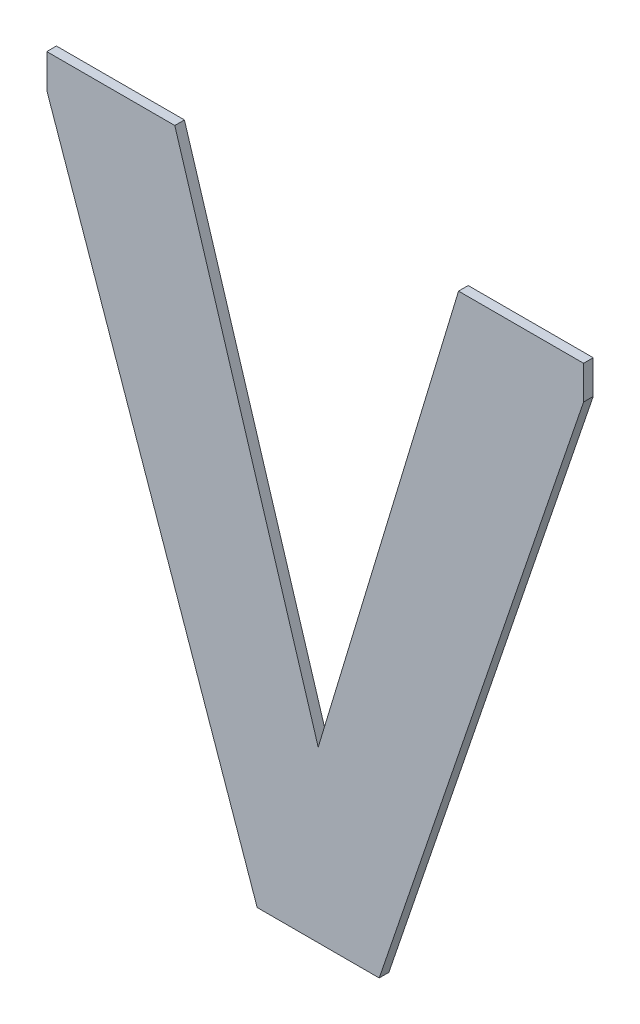
ISO-10303-21;
HEADER;
FILE_DESCRIPTION(('STEP AP214'),'2;1');
FILE_NAME('part.step','',(''),(''),'','','');
FILE_SCHEMA(('AUTOMOTIVE_DESIGN { 1 0 10303 214 1 1 1 1 }'));
ENDSEC;
DATA;
#1=APPLICATION_CONTEXT('core data for automotive mechanical design processes');
#2=APPLICATION_PROTOCOL_DEFINITION('international standard','automotive_design',2000,#1);
#3=PRODUCT_CONTEXT('',#1,'mechanical');
#4=PRODUCT('Part','Part','',(#3));
#5=PRODUCT_RELATED_PRODUCT_CATEGORY('part','',(#4));
#6=PRODUCT_DEFINITION_FORMATION('','',#4);
#7=PRODUCT_DEFINITION_CONTEXT('part definition',#1,'design');
#8=PRODUCT_DEFINITION('design','',#6,#7);
#9=PRODUCT_DEFINITION_SHAPE('','',#8);
#10=(LENGTH_UNIT() NAMED_UNIT(*) SI_UNIT(.MILLI.,.METRE.));
#11=(NAMED_UNIT(*) PLANE_ANGLE_UNIT() SI_UNIT($,.RADIAN.));
#12=(NAMED_UNIT(*) SI_UNIT($,.STERADIAN.) SOLID_ANGLE_UNIT());
#13=UNCERTAINTY_MEASURE_WITH_UNIT(LENGTH_MEASURE(1.E-05),#10,'distance_accuracy_value','');
#14=(GEOMETRIC_REPRESENTATION_CONTEXT(3) GLOBAL_UNCERTAINTY_ASSIGNED_CONTEXT((#13)) GLOBAL_UNIT_ASSIGNED_CONTEXT((#10,
#11,#12)) REPRESENTATION_CONTEXT('',''));
#15=CARTESIAN_POINT('',(0.,0.,0.));
#16=DIRECTION('',(0.,0.,1.));
#17=DIRECTION('',(1.,0.,0.));
#18=AXIS2_PLACEMENT_3D('',#15,#16,#17);
#19=CARTESIAN_POINT('',(3.2441487083548,-0.722389912967327,0.));
#20=DIRECTION('',(0.,1.,0.));
#21=DIRECTION('',(-1.,0.,0.));
#22=AXIS2_PLACEMENT_3D('',#19,#20,#21);
#23=PLANE('',#22);
#24=DIRECTION('',(-1.,0.,0.));
#25=VECTOR('',#24,1.);
#26=CARTESIAN_POINT('',(3.2441487083548,-0.722389912967327,0.));
#27=LINE('',#26,#25);
#28=CARTESIAN_POINT('',(3.2441487083548,-0.722389912967327,0.));
#29=VERTEX_POINT('',#28);
#30=CARTESIAN_POINT('',(3.2043187112414,-0.722389912967327,0.));
#31=VERTEX_POINT('',#30);
#32=EDGE_CURVE('E11',#29,#31,#27,.T.);
#33=ORIENTED_EDGE('',*,*,#32,.T.);
#34=DIRECTION('',(0.,0.,1.));
#35=VECTOR('',#34,1.);
#36=CARTESIAN_POINT('',(3.2043187112414,-0.722389912967327,0.));
#37=LINE('',#36,#35);
#38=CARTESIAN_POINT('',(3.2043187112414,-0.722389912967327,0.003));
#39=VERTEX_POINT('',#38);
#40=EDGE_CURVE('E24',#31,#39,#37,.T.);
#41=ORIENTED_EDGE('',*,*,#40,.T.);
#42=DIRECTION('',(-1.,0.,0.));
#43=VECTOR('',#42,1.);
#44=CARTESIAN_POINT('',(3.2441487083548,-0.722389912967327,0.003));
#45=LINE('',#44,#43);
#46=CARTESIAN_POINT('',(3.2441487083548,-0.722389912967327,0.003));
#47=VERTEX_POINT('',#46);
#48=EDGE_CURVE('E106',#47,#39,#45,.T.);
#49=ORIENTED_EDGE('',*,*,#48,.F.);
#50=DIRECTION('',(0.,0.,1.));
#51=VECTOR('',#50,1.);
#52=CARTESIAN_POINT('',(3.2441487083548,-0.722389912967327,0.));
#53=LINE('',#52,#51);
#54=EDGE_CURVE('E161',#29,#47,#53,.T.);
#55=ORIENTED_EDGE('',*,*,#54,.F.);
#56=EDGE_LOOP('',(#33,#41,#49,#55));
#57=FACE_BOUND('',#56,.T.);
#58=ADVANCED_FACE('F17',(#57),#23,.T.);
#59=CARTESIAN_POINT('',(3.2887624352329,-0.867592688611885,0.));
#60=DIRECTION('',(0.955897450324784,0.293700637490928,0.));
#61=DIRECTION('',(-0.293700637490928,0.955897450324784,0.));
#62=AXIS2_PLACEMENT_3D('',#59,#60,#61);
#63=PLANE('',#62);
#64=DIRECTION('',(-0.293700637490928,0.955897450324784,0.));
#65=VECTOR('',#64,1.);
#66=CARTESIAN_POINT('',(3.2887624352329,-0.867592688611885,0.));
#67=LINE('',#66,#65);
#68=CARTESIAN_POINT('',(3.2887624352329,-0.867592688611885,0.));
#69=VERTEX_POINT('',#68);
#70=EDGE_CURVE('E158',#69,#29,#67,.T.);
#71=ORIENTED_EDGE('',*,*,#70,.T.);
#72=ORIENTED_EDGE('',*,*,#54,.T.);
#73=DIRECTION('',(-0.293700637490928,0.955897450324784,0.));
#74=VECTOR('',#73,1.);
#75=CARTESIAN_POINT('',(3.2887624352329,-0.867592688611885,0.003));
#76=LINE('',#75,#74);
#77=CARTESIAN_POINT('',(3.2887624352329,-0.867592688611885,0.003));
#78=VERTEX_POINT('',#77);
#79=EDGE_CURVE('E156',#78,#47,#76,.T.);
#80=ORIENTED_EDGE('',*,*,#79,.F.);
#81=DIRECTION('',(0.,0.,1.));
#82=VECTOR('',#81,1.);
#83=CARTESIAN_POINT('',(3.2887624352329,-0.867592688611885,0.));
#84=LINE('',#83,#82);
#85=EDGE_CURVE('E153',#69,#78,#84,.T.);
#86=ORIENTED_EDGE('',*,*,#85,.F.);
#87=EDGE_LOOP('',(#71,#72,#80,#86));
#88=FACE_BOUND('',#87,.T.);
#89=ADVANCED_FACE('F181',(#88),#63,.T.);
#90=CARTESIAN_POINT('',(3.3324203634316,-0.722871127763473,0.));
#91=DIRECTION('',(-0.957385527935422,0.288813003342672,0.));
#92=DIRECTION('',(-0.288813003342672,-0.957385527935422,0.));
#93=AXIS2_PLACEMENT_3D('',#90,#91,#92);
#94=PLANE('',#93);
#95=DIRECTION('',(-0.288813003342672,-0.957385527935421,0.));
#96=VECTOR('',#95,1.);
#97=CARTESIAN_POINT('',(3.3324203634316,-0.722871127763473,0.));
#98=LINE('',#97,#96);
#99=CARTESIAN_POINT('',(3.3324203634316,-0.722871127763473,0.));
#100=VERTEX_POINT('',#99);
#101=EDGE_CURVE('E150',#100,#69,#98,.T.);
#102=ORIENTED_EDGE('',*,*,#101,.T.);
#103=ORIENTED_EDGE('',*,*,#85,.T.);
#104=DIRECTION('',(-0.288813003342672,-0.957385527935421,0.));
#105=VECTOR('',#104,1.);
#106=CARTESIAN_POINT('',(3.3324203634316,-0.722871127763473,0.003));
#107=LINE('',#106,#105);
#108=CARTESIAN_POINT('',(3.3324203634316,-0.722871127763473,0.003));
#109=VERTEX_POINT('',#108);
#110=EDGE_CURVE('E147',#109,#78,#107,.T.);
#111=ORIENTED_EDGE('',*,*,#110,.F.);
#112=DIRECTION('',(0.,0.,1.));
#113=VECTOR('',#112,1.);
#114=CARTESIAN_POINT('',(3.3324203634316,-0.722871127763473,0.));
#115=LINE('',#114,#113);
#116=EDGE_CURVE('E144',#100,#109,#115,.T.);
#117=ORIENTED_EDGE('',*,*,#116,.F.);
#118=EDGE_LOOP('',(#102,#103,#111,#117));
#119=FACE_BOUND('',#118,.T.);
#120=ADVANCED_FACE('F178',(#119),#94,.T.);
#121=CARTESIAN_POINT('',(3.3713248746082,-0.722871127763473,0.));
#122=DIRECTION('',(0.,1.,0.));
#123=DIRECTION('',(-1.,0.,0.));
#124=AXIS2_PLACEMENT_3D('',#121,#122,#123);
#125=PLANE('',#124);
#126=DIRECTION('',(-1.,0.,0.));
#127=VECTOR('',#126,1.);
#128=CARTESIAN_POINT('',(3.3713248746082,-0.722871127763473,0.));
#129=LINE('',#128,#127);
#130=CARTESIAN_POINT('',(3.3713248746082,-0.722871127763473,0.));
#131=VERTEX_POINT('',#130);
#132=EDGE_CURVE('E141',#131,#100,#129,.T.);
#133=ORIENTED_EDGE('',*,*,#132,.T.);
#134=ORIENTED_EDGE('',*,*,#116,.T.);
#135=DIRECTION('',(-1.,0.,0.));
#136=VECTOR('',#135,1.);
#137=CARTESIAN_POINT('',(3.3713248746082,-0.722871127763473,0.003));
#138=LINE('',#137,#136);
#139=CARTESIAN_POINT('',(3.3713248746082,-0.722871127763473,0.003));
#140=VERTEX_POINT('',#139);
#141=EDGE_CURVE('E138',#140,#109,#138,.T.);
#142=ORIENTED_EDGE('',*,*,#141,.F.);
#143=DIRECTION('',(0.,0.,1.));
#144=VECTOR('',#143,1.);
#145=CARTESIAN_POINT('',(3.3713248746082,-0.722871127763473,0.));
#146=LINE('',#145,#144);
#147=EDGE_CURVE('E135',#131,#140,#146,.T.);
#148=ORIENTED_EDGE('',*,*,#147,.F.);
#149=EDGE_LOOP('',(#133,#134,#142,#148));
#150=FACE_BOUND('',#149,.T.);
#151=ADVANCED_FACE('F175',(#150),#125,.T.);
#152=CARTESIAN_POINT('',(3.3713248746082,-0.733306289563397,0.));
#153=DIRECTION('',(1.,0.,0.));
#154=DIRECTION('',(0.,1.,0.));
#155=AXIS2_PLACEMENT_3D('',#152,#153,#154);
#156=PLANE('',#155);
#157=DIRECTION('',(0.,1.,0.));
#158=VECTOR('',#157,1.);
#159=CARTESIAN_POINT('',(3.3713248746082,-0.733306289563397,0.));
#160=LINE('',#159,#158);
#161=CARTESIAN_POINT('',(3.3713248746082,-0.733306289563397,0.));
#162=VERTEX_POINT('',#161);
#163=EDGE_CURVE('E132',#162,#131,#160,.T.);
#164=ORIENTED_EDGE('',*,*,#163,.T.);
#165=ORIENTED_EDGE('',*,*,#147,.T.);
#166=DIRECTION('',(0.,1.,0.));
#167=VECTOR('',#166,1.);
#168=CARTESIAN_POINT('',(3.3713248746082,-0.733306289563397,0.003));
#169=LINE('',#168,#167);
#170=CARTESIAN_POINT('',(3.3713248746082,-0.733306289563397,0.003));
#171=VERTEX_POINT('',#170);
#172=EDGE_CURVE('E129',#171,#140,#169,.T.);
#173=ORIENTED_EDGE('',*,*,#172,.F.);
#174=DIRECTION('',(0.,0.,1.));
#175=VECTOR('',#174,1.);
#176=CARTESIAN_POINT('',(3.3713248746082,-0.733306289563397,0.));
#177=LINE('',#176,#175);
#178=EDGE_CURVE('E126',#162,#171,#177,.T.);
#179=ORIENTED_EDGE('',*,*,#178,.F.);
#180=EDGE_LOOP('',(#164,#165,#173,#179));
#181=FACE_BOUND('',#180,.T.);
#182=ADVANCED_FACE('F172',(#181),#156,.T.);
#183=CARTESIAN_POINT('',(3.3077438960305,-0.920280972424119,0.));
#184=DIRECTION('',(0.946757949931285,-0.321946244335774,0.));
#185=DIRECTION('',(0.321946244335774,0.946757949931285,0.));
#186=AXIS2_PLACEMENT_3D('',#183,#184,#185);
#187=PLANE('',#186);
#188=DIRECTION('',(0.321946244335774,0.946757949931285,0.));
#189=VECTOR('',#188,1.);
#190=CARTESIAN_POINT('',(3.3077438960305,-0.920280972424119,0.));
#191=LINE('',#190,#189);
#192=CARTESIAN_POINT('',(3.3077438960305,-0.920280972424119,0.));
#193=VERTEX_POINT('',#192);
#194=EDGE_CURVE('E123',#193,#162,#191,.T.);
#195=ORIENTED_EDGE('',*,*,#194,.T.);
#196=ORIENTED_EDGE('',*,*,#178,.T.);
#197=DIRECTION('',(0.321946244335774,0.946757949931285,0.));
#198=VECTOR('',#197,1.);
#199=CARTESIAN_POINT('',(3.3077438960305,-0.920280972424119,0.003));
#200=LINE('',#199,#198);
#201=CARTESIAN_POINT('',(3.3077438960305,-0.920280972424119,0.003));
#202=VERTEX_POINT('',#201);
#203=EDGE_CURVE('E120',#202,#171,#200,.T.);
#204=ORIENTED_EDGE('',*,*,#203,.F.);
#205=DIRECTION('',(0.,0.,1.));
#206=VECTOR('',#205,1.);
#207=CARTESIAN_POINT('',(3.3077438960305,-0.920280972424119,0.));
#208=LINE('',#207,#206);
#209=EDGE_CURVE('E117',#193,#202,#208,.T.);
#210=ORIENTED_EDGE('',*,*,#209,.F.);
#211=EDGE_LOOP('',(#195,#196,#204,#210));
#212=FACE_BOUND('',#211,.T.);
#213=ADVANCED_FACE('F169',(#212),#187,.T.);
#214=CARTESIAN_POINT('',(3.2697800271621,-0.920280972424119,0.));
#215=DIRECTION('',(0.,-1.,0.));
#216=DIRECTION('',(1.,0.,0.));
#217=AXIS2_PLACEMENT_3D('',#214,#215,#216);
#218=PLANE('',#217);
#219=DIRECTION('',(1.,0.,0.));
#220=VECTOR('',#219,1.);
#221=CARTESIAN_POINT('',(3.2697800271621,-0.920280972424119,0.));
#222=LINE('',#221,#220);
#223=CARTESIAN_POINT('',(3.2697800271621,-0.920280972424119,0.));
#224=VERTEX_POINT('',#223);
#225=EDGE_CURVE('E114',#224,#193,#222,.T.);
#226=ORIENTED_EDGE('',*,*,#225,.T.);
#227=ORIENTED_EDGE('',*,*,#209,.T.);
#228=DIRECTION('',(1.,0.,0.));
#229=VECTOR('',#228,1.);
#230=CARTESIAN_POINT('',(3.2697800271621,-0.920280972424119,0.003));
#231=LINE('',#230,#229);
#232=CARTESIAN_POINT('',(3.2697800271621,-0.920280972424119,0.003));
#233=VERTEX_POINT('',#232);
#234=EDGE_CURVE('E112',#233,#202,#231,.T.);
#235=ORIENTED_EDGE('',*,*,#234,.F.);
#236=DIRECTION('',(0.,0.,1.));
#237=VECTOR('',#236,1.);
#238=CARTESIAN_POINT('',(3.2697800271621,-0.920280972424119,0.));
#239=LINE('',#238,#237);
#240=EDGE_CURVE('E91',#224,#233,#239,.T.);
#241=ORIENTED_EDGE('',*,*,#240,.F.);
#242=EDGE_LOOP('',(#226,#227,#235,#241));
#243=FACE_BOUND('',#242,.T.);
#244=ADVANCED_FACE('F167',(#243),#218,.T.);
#245=CARTESIAN_POINT('',(3.2043187112414,-0.732843072958441,0.));
#246=DIRECTION('',(-0.944081069949812,-0.329713410953238,0.));
#247=DIRECTION('',(0.329713410953238,-0.944081069949812,0.));
#248=AXIS2_PLACEMENT_3D('',#245,#246,#247);
#249=PLANE('',#248);
#250=DIRECTION('',(0.329713410953238,-0.944081069949812,0.));
#251=VECTOR('',#250,1.);
#252=CARTESIAN_POINT('',(3.2043187112414,-0.732843072958441,0.));
#253=LINE('',#252,#251);
#254=CARTESIAN_POINT('',(3.2043187112414,-0.732843072958441,0.));
#255=VERTEX_POINT('',#254);
#256=EDGE_CURVE('E95',#255,#224,#253,.T.);
#257=ORIENTED_EDGE('',*,*,#256,.T.);
#258=ORIENTED_EDGE('',*,*,#240,.T.);
#259=DIRECTION('',(0.329713410953238,-0.944081069949812,0.));
#260=VECTOR('',#259,1.);
#261=CARTESIAN_POINT('',(3.2043187112414,-0.732843072958441,0.003));
#262=LINE('',#261,#260);
#263=CARTESIAN_POINT('',(3.2043187112414,-0.732843072958441,0.003));
#264=VERTEX_POINT('',#263);
#265=EDGE_CURVE('E84',#264,#233,#262,.T.);
#266=ORIENTED_EDGE('',*,*,#265,.F.);
#267=DIRECTION('',(0.,0.,1.));
#268=VECTOR('',#267,1.);
#269=CARTESIAN_POINT('',(3.2043187112414,-0.732843072958441,0.));
#270=LINE('',#269,#268);
#271=EDGE_CURVE('E88',#255,#264,#270,.T.);
#272=ORIENTED_EDGE('',*,*,#271,.F.);
#273=EDGE_LOOP('',(#257,#258,#266,#272));
#274=FACE_BOUND('',#273,.T.);
#275=ADVANCED_FACE('F87',(#274),#249,.T.);
#276=CARTESIAN_POINT('',(3.2043187112414,-0.722389912967327,0.));
#277=DIRECTION('',(-1.,0.,0.));
#278=DIRECTION('',(0.,-1.,0.));
#279=AXIS2_PLACEMENT_3D('',#276,#277,#278);
#280=PLANE('',#279);
#281=DIRECTION('',(0.,-1.,0.));
#282=VECTOR('',#281,1.);
#283=CARTESIAN_POINT('',(3.2043187112414,-0.722389912967327,0.));
#284=LINE('',#283,#282);
#285=EDGE_CURVE('E101',#31,#255,#284,.T.);
#286=ORIENTED_EDGE('',*,*,#285,.T.);
#287=ORIENTED_EDGE('',*,*,#271,.T.);
#288=DIRECTION('',(0.,-1.,0.));
#289=VECTOR('',#288,1.);
#290=CARTESIAN_POINT('',(3.2043187112414,-0.722389912967327,0.003));
#291=LINE('',#290,#289);
#292=EDGE_CURVE('E100',#39,#264,#291,.T.);
#293=ORIENTED_EDGE('',*,*,#292,.F.);
#294=ORIENTED_EDGE('',*,*,#40,.F.);
#295=EDGE_LOOP('',(#286,#287,#293,#294));
#296=FACE_BOUND('',#295,.T.);
#297=ADVANCED_FACE('F99',(#296),#280,.T.);
#298=CARTESIAN_POINT('',(3.2878217929248,-0.821335442695723,0.003));
#299=DIRECTION('',(0.,0.,1.));
#300=DIRECTION('',(1.,0.,0.));
#301=AXIS2_PLACEMENT_3D('',#298,#299,#300);
#302=PLANE('',#301);
#303=ORIENTED_EDGE('',*,*,#292,.T.);
#304=ORIENTED_EDGE('',*,*,#265,.T.);
#305=ORIENTED_EDGE('',*,*,#234,.T.);
#306=ORIENTED_EDGE('',*,*,#203,.T.);
#307=ORIENTED_EDGE('',*,*,#172,.T.);
#308=ORIENTED_EDGE('',*,*,#141,.T.);
#309=ORIENTED_EDGE('',*,*,#110,.T.);
#310=ORIENTED_EDGE('',*,*,#79,.T.);
#311=ORIENTED_EDGE('',*,*,#48,.T.);
#312=EDGE_LOOP('',(#303,#304,#305,#306,#307,#308,#309,#310,#311));
#313=FACE_BOUND('',#312,.T.);
#314=ADVANCED_FACE('F104',(#313),#302,.T.);
#315=CARTESIAN_POINT('',(3.2878217929248,-0.821335442695723,0.));
#316=DIRECTION('',(0.,0.,1.));
#317=DIRECTION('',(1.,0.,0.));
#318=AXIS2_PLACEMENT_3D('',#315,#316,#317);
#319=PLANE('',#318);
#320=ORIENTED_EDGE('',*,*,#285,.F.);
#321=ORIENTED_EDGE('',*,*,#32,.F.);
#322=ORIENTED_EDGE('',*,*,#70,.F.);
#323=ORIENTED_EDGE('',*,*,#101,.F.);
#324=ORIENTED_EDGE('',*,*,#132,.F.);
#325=ORIENTED_EDGE('',*,*,#163,.F.);
#326=ORIENTED_EDGE('',*,*,#194,.F.);
#327=ORIENTED_EDGE('',*,*,#225,.F.);
#328=ORIENTED_EDGE('',*,*,#256,.F.);
#329=EDGE_LOOP('',(#320,#321,#322,#323,#324,#325,#326,#327,#328));
#330=FACE_BOUND('',#329,.T.);
#331=ADVANCED_FACE('F164',(#330),#319,.F.);
#332=CLOSED_SHELL('',(#58,#89,#120,#151,#182,#213,#244,#275,#297,#314,#331));
#333=MANIFOLD_SOLID_BREP('B1',#332);
#334=ADVANCED_BREP_SHAPE_REPRESENTATION('',(#18,#333),#14);
#335=SHAPE_DEFINITION_REPRESENTATION(#9,#334);
ENDSEC;
END-ISO-10303-21;
